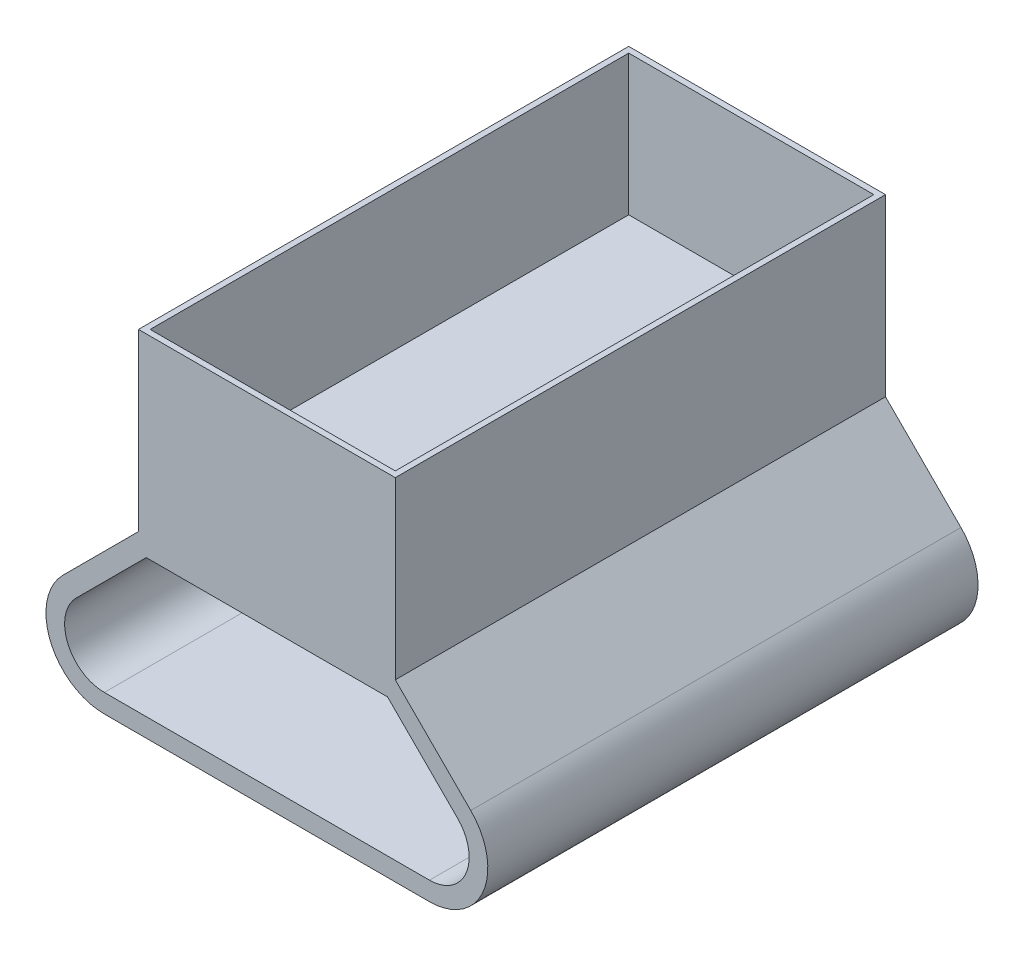
ISO-10303-21;
HEADER;
FILE_DESCRIPTION(('STEP AP214'),'2;1');
FILE_NAME('part.step','',(''),(''),'','','');
FILE_SCHEMA(('AUTOMOTIVE_DESIGN { 1 0 10303 214 1 1 1 1 }'));
ENDSEC;
DATA;
#1=APPLICATION_CONTEXT('core data for automotive mechanical design processes');
#2=APPLICATION_PROTOCOL_DEFINITION('international standard','automotive_design',2000,#1);
#3=PRODUCT_CONTEXT('',#1,'mechanical');
#4=PRODUCT('Part','Part','',(#3));
#5=PRODUCT_RELATED_PRODUCT_CATEGORY('part','',(#4));
#6=PRODUCT_DEFINITION_FORMATION('','',#4);
#7=PRODUCT_DEFINITION_CONTEXT('part definition',#1,'design');
#8=PRODUCT_DEFINITION('design','',#6,#7);
#9=PRODUCT_DEFINITION_SHAPE('','',#8);
#10=(LENGTH_UNIT() NAMED_UNIT(*) SI_UNIT(.MILLI.,.METRE.));
#11=(NAMED_UNIT(*) PLANE_ANGLE_UNIT() SI_UNIT($,.RADIAN.));
#12=(NAMED_UNIT(*) SI_UNIT($,.STERADIAN.) SOLID_ANGLE_UNIT());
#13=UNCERTAINTY_MEASURE_WITH_UNIT(LENGTH_MEASURE(1.E-05),#10,'distance_accuracy_value','');
#14=(GEOMETRIC_REPRESENTATION_CONTEXT(3) GLOBAL_UNCERTAINTY_ASSIGNED_CONTEXT((#13)) GLOBAL_UNIT_ASSIGNED_CONTEXT((#10,
#11,#12)) REPRESENTATION_CONTEXT('',''));
#15=CARTESIAN_POINT('',(0.,0.,0.));
#16=DIRECTION('',(0.,0.,1.));
#17=DIRECTION('',(1.,0.,0.));
#18=AXIS2_PLACEMENT_3D('',#15,#16,#17);
#19=CARTESIAN_POINT('',(-10.9999999999999,-1.73472347597681E-13,42.));
#20=DIRECTION('',(0.707106781186544,-0.707106781186551,0.));
#21=DIRECTION('',(0.707106781186551,0.707106781186544,0.));
#22=AXIS2_PLACEMENT_3D('',#19,#20,#21);
#23=PLANE('',#22);
#24=DIRECTION('',(-0.707106781186551,-0.707106781186544,0.));
#25=VECTOR('',#24,1.);
#26=CARTESIAN_POINT('',(-10.9999999999999,-1.73472347597681E-13,0.));
#27=LINE('',#26,#25);
#28=CARTESIAN_POINT('',(-10.9999999999999,0.,0.));
#29=VERTEX_POINT('',#28);
#30=CARTESIAN_POINT('',(-17.4644660940673,-6.46446609406727,0.));
#31=VERTEX_POINT('',#30);
#32=EDGE_CURVE('E254',#29,#31,#27,.T.);
#33=ORIENTED_EDGE('',*,*,#32,.T.);
#34=DIRECTION('',(0.,0.,-1.));
#35=VECTOR('',#34,1.);
#36=CARTESIAN_POINT('',(-17.4644660940673,-6.46446609406727,42.));
#37=LINE('',#36,#35);
#38=CARTESIAN_POINT('',(-17.4644660940673,-6.46446609406727,42.));
#39=VERTEX_POINT('',#38);
#40=EDGE_CURVE('E11',#39,#31,#37,.T.);
#41=ORIENTED_EDGE('',*,*,#40,.F.);
#42=DIRECTION('',(-0.707106781186551,-0.707106781186544,0.));
#43=VECTOR('',#42,1.);
#44=CARTESIAN_POINT('',(-10.9999999999999,-1.73472347597681E-13,42.));
#45=LINE('',#44,#43);
#46=CARTESIAN_POINT('',(-10.9999999999999,-1.73472347597681E-13,42.));
#47=VERTEX_POINT('',#46);
#48=EDGE_CURVE('E265',#47,#39,#45,.T.);
#49=ORIENTED_EDGE('',*,*,#48,.F.);
#50=DIRECTION('',(0.,0.,-1.));
#51=VECTOR('',#50,1.);
#52=CARTESIAN_POINT('',(-10.9999999999999,-1.73472347597681E-13,42.));
#53=LINE('',#52,#51);
#54=EDGE_CURVE('E277',#47,#29,#53,.T.);
#55=ORIENTED_EDGE('',*,*,#54,.T.);
#56=EDGE_LOOP('',(#33,#41,#49,#55));
#57=FACE_BOUND('',#56,.T.);
#58=ADVANCED_FACE('F35',(#57),#23,.F.);
#59=CARTESIAN_POINT('',(-13.9289321881346,-10.,42.));
#60=DIRECTION('',(0.,0.,-1.));
#61=DIRECTION('',(-1.,0.,0.));
#62=AXIS2_PLACEMENT_3D('',#59,#60,#61);
#63=CYLINDRICAL_SURFACE('',#62,4.99999999999998);
#64=CARTESIAN_POINT('',(-13.9289321881346,-10.,0.));
#65=DIRECTION('',(0.,0.,1.));
#66=DIRECTION('',(1.,0.,0.));
#67=AXIS2_PLACEMENT_3D('',#64,#65,#66);
#68=CIRCLE('',#67,4.99999999999998);
#69=CARTESIAN_POINT('',(-13.9289321881344,-15.0000000000002,0.));
#70=VERTEX_POINT('',#69);
#71=EDGE_CURVE('E280',#31,#70,#68,.T.);
#72=ORIENTED_EDGE('',*,*,#71,.T.);
#73=DIRECTION('',(0.,0.,-1.));
#74=VECTOR('',#73,1.);
#75=CARTESIAN_POINT('',(-13.9289321881344,-15.0000000000002,42.));
#76=LINE('',#75,#74);
#77=CARTESIAN_POINT('',(-13.9289321881344,-15.0000000000002,42.));
#78=VERTEX_POINT('',#77);
#79=EDGE_CURVE('E42',#78,#70,#76,.T.);
#80=ORIENTED_EDGE('',*,*,#79,.F.);
#81=CARTESIAN_POINT('',(-13.9289321881346,-10.,42.));
#82=DIRECTION('',(0.,0.,1.));
#83=DIRECTION('',(1.,0.,0.));
#84=AXIS2_PLACEMENT_3D('',#81,#82,#83);
#85=CIRCLE('',#84,4.99999999999998);
#86=EDGE_CURVE('E268',#39,#78,#85,.T.);
#87=ORIENTED_EDGE('',*,*,#86,.F.);
#88=ORIENTED_EDGE('',*,*,#40,.T.);
#89=EDGE_LOOP('',(#72,#80,#87,#88));
#90=FACE_BOUND('',#89,.T.);
#91=ADVANCED_FACE('F322',(#90),#63,.T.);
#92=CARTESIAN_POINT('',(-13.9289321881344,-15.0000000000002,42.));
#93=DIRECTION('',(0.,1.,0.));
#94=DIRECTION('',(-1.,0.,0.));
#95=AXIS2_PLACEMENT_3D('',#92,#93,#94);
#96=PLANE('',#95);
#97=DIRECTION('',(1.,0.,0.));
#98=VECTOR('',#97,1.);
#99=CARTESIAN_POINT('',(-13.9289321881344,-15.0000000000002,0.));
#100=LINE('',#99,#98);
#101=CARTESIAN_POINT('',(13.9289321881345,-14.9999999999999,0.));
#102=VERTEX_POINT('',#101);
#103=EDGE_CURVE('E282',#70,#102,#100,.T.);
#104=ORIENTED_EDGE('',*,*,#103,.T.);
#105=DIRECTION('',(0.,0.,-1.));
#106=VECTOR('',#105,1.);
#107=CARTESIAN_POINT('',(13.9289321881345,-14.9999999999999,42.));
#108=LINE('',#107,#106);
#109=CARTESIAN_POINT('',(13.9289321881345,-14.9999999999999,42.));
#110=VERTEX_POINT('',#109);
#111=EDGE_CURVE('E295',#110,#102,#108,.T.);
#112=ORIENTED_EDGE('',*,*,#111,.F.);
#113=DIRECTION('',(1.,0.,0.));
#114=VECTOR('',#113,1.);
#115=CARTESIAN_POINT('',(-13.9289321881344,-15.0000000000002,42.));
#116=LINE('',#115,#114);
#117=EDGE_CURVE('E271',#78,#110,#116,.T.);
#118=ORIENTED_EDGE('',*,*,#117,.F.);
#119=ORIENTED_EDGE('',*,*,#79,.T.);
#120=EDGE_LOOP('',(#104,#112,#118,#119));
#121=FACE_BOUND('',#120,.T.);
#122=ADVANCED_FACE('F302',(#121),#96,.F.);
#123=CARTESIAN_POINT('',(13.9289321881346,-9.99999999999999,42.));
#124=DIRECTION('',(0.,0.,-1.));
#125=DIRECTION('',(-1.,0.,0.));
#126=AXIS2_PLACEMENT_3D('',#123,#124,#125);
#127=CYLINDRICAL_SURFACE('',#126,4.99999999999994);
#128=CARTESIAN_POINT('',(13.9289321881346,-9.99999999999999,0.));
#129=DIRECTION('',(0.,0.,1.));
#130=DIRECTION('',(1.,0.,0.));
#131=AXIS2_PLACEMENT_3D('',#128,#129,#130);
#132=CIRCLE('',#131,4.99999999999994);
#133=CARTESIAN_POINT('',(17.4644660940674,-6.46446609406748,0.));
#134=VERTEX_POINT('',#133);
#135=EDGE_CURVE('E284',#102,#134,#132,.T.);
#136=ORIENTED_EDGE('',*,*,#135,.T.);
#137=DIRECTION('',(0.,0.,-1.));
#138=VECTOR('',#137,1.);
#139=CARTESIAN_POINT('',(17.4644660940674,-6.46446609406748,42.));
#140=LINE('',#139,#138);
#141=CARTESIAN_POINT('',(17.4644660940674,-6.46446609406748,42.));
#142=VERTEX_POINT('',#141);
#143=EDGE_CURVE('E292',#142,#134,#140,.T.);
#144=ORIENTED_EDGE('',*,*,#143,.F.);
#145=CARTESIAN_POINT('',(13.9289321881346,-9.99999999999999,42.));
#146=DIRECTION('',(0.,0.,1.));
#147=DIRECTION('',(1.,0.,0.));
#148=AXIS2_PLACEMENT_3D('',#145,#146,#147);
#149=CIRCLE('',#148,4.99999999999994);
#150=EDGE_CURVE('E273',#110,#142,#149,.T.);
#151=ORIENTED_EDGE('',*,*,#150,.F.);
#152=ORIENTED_EDGE('',*,*,#111,.T.);
#153=EDGE_LOOP('',(#136,#144,#151,#152));
#154=FACE_BOUND('',#153,.T.);
#155=ADVANCED_FACE('F311',(#154),#127,.T.);
#156=CARTESIAN_POINT('',(17.4644660940674,-6.46446609406748,42.));
#157=DIRECTION('',(-0.707106781186554,-0.707106781186541,0.));
#158=DIRECTION('',(0.707106781186541,-0.707106781186554,0.));
#159=AXIS2_PLACEMENT_3D('',#156,#157,#158);
#160=PLANE('',#159);
#161=DIRECTION('',(-0.707106781186541,0.707106781186554,0.));
#162=VECTOR('',#161,1.);
#163=CARTESIAN_POINT('',(17.4644660940674,-6.46446609406748,0.));
#164=LINE('',#163,#162);
#165=CARTESIAN_POINT('',(11.,0.,0.));
#166=VERTEX_POINT('',#165);
#167=EDGE_CURVE('E269',#134,#166,#164,.T.);
#168=ORIENTED_EDGE('',*,*,#167,.T.);
#169=DIRECTION('',(0.,0.,-1.));
#170=VECTOR('',#169,1.);
#171=CARTESIAN_POINT('',(11.,0.,42.));
#172=LINE('',#171,#170);
#173=CARTESIAN_POINT('',(11.,0.,42.));
#174=VERTEX_POINT('',#173);
#175=EDGE_CURVE('E289',#174,#166,#172,.T.);
#176=ORIENTED_EDGE('',*,*,#175,.F.);
#177=DIRECTION('',(-0.707106781186541,0.707106781186554,0.));
#178=VECTOR('',#177,1.);
#179=CARTESIAN_POINT('',(17.4644660940674,-6.46446609406748,42.));
#180=LINE('',#179,#178);
#181=EDGE_CURVE('E275',#142,#174,#180,.T.);
#182=ORIENTED_EDGE('',*,*,#181,.F.);
#183=ORIENTED_EDGE('',*,*,#143,.T.);
#184=EDGE_LOOP('',(#168,#176,#182,#183));
#185=FACE_BOUND('',#184,.T.);
#186=ADVANCED_FACE('F315',(#185),#160,.F.);
#187=CARTESIAN_POINT('',(-13.9289321881346,-10.,42.));
#188=DIRECTION('',(0.,0.,1.));
#189=DIRECTION('',(1.,0.,0.));
#190=AXIS2_PLACEMENT_3D('',#187,#188,#189);
#191=PLANE('',#190);
#192=CARTESIAN_POINT('',(13.9289321881346,-9.99999999999999,42.));
#193=DIRECTION('',(0.,0.,1.));
#194=DIRECTION('',(1.,0.,0.));
#195=AXIS2_PLACEMENT_3D('',#192,#193,#194);
#196=CIRCLE('',#195,3.39999999999991);
#197=CARTESIAN_POINT('',(13.9289321881345,-13.3999999999999,42.));
#198=VERTEX_POINT('',#197);
#199=CARTESIAN_POINT('',(16.3330952441689,-7.59583694396589,42.));
#200=VERTEX_POINT('',#199);
#201=EDGE_CURVE('E216',#198,#200,#196,.T.);
#202=ORIENTED_EDGE('',*,*,#201,.F.);
#203=DIRECTION('',(1.,0.,0.));
#204=VECTOR('',#203,1.);
#205=CARTESIAN_POINT('',(-13.9289321881345,-13.4000000000001,42.));
#206=LINE('',#205,#204);
#207=CARTESIAN_POINT('',(-13.9289321881345,-13.4000000000001,42.));
#208=VERTEX_POINT('',#207);
#209=EDGE_CURVE('E221',#208,#198,#206,.T.);
#210=ORIENTED_EDGE('',*,*,#209,.F.);
#211=CARTESIAN_POINT('',(-13.9289321881346,-10.,42.));
#212=DIRECTION('',(0.,0.,1.));
#213=DIRECTION('',(1.,0.,0.));
#214=AXIS2_PLACEMENT_3D('',#211,#212,#213);
#215=CIRCLE('',#214,3.40000000000003);
#216=CARTESIAN_POINT('',(-16.3330952441689,-7.59583694396575,42.));
#217=VERTEX_POINT('',#216);
#218=EDGE_CURVE('E247',#217,#208,#215,.T.);
#219=ORIENTED_EDGE('',*,*,#218,.F.);
#220=DIRECTION('',(-0.707106781186566,-0.707106781186528,0.));
#221=VECTOR('',#220,1.);
#222=CARTESIAN_POINT('',(-10.3372583002029,-1.60000000000017,42.));
#223=LINE('',#222,#221);
#224=CARTESIAN_POINT('',(-10.3372583002029,-1.60000000000017,42.));
#225=VERTEX_POINT('',#224);
#226=EDGE_CURVE('E244',#225,#217,#223,.T.);
#227=ORIENTED_EDGE('',*,*,#226,.F.);
#228=DIRECTION('',(-1.,0.,0.));
#229=VECTOR('',#228,1.);
#230=CARTESIAN_POINT('',(10.337258300203,-1.6,42.));
#231=LINE('',#230,#229);
#232=CARTESIAN_POINT('',(10.337258300203,-1.6,42.));
#233=VERTEX_POINT('',#232);
#234=EDGE_CURVE('E241',#233,#225,#231,.T.);
#235=ORIENTED_EDGE('',*,*,#234,.F.);
#236=DIRECTION('',(-0.707106781186544,0.707106781186551,0.));
#237=VECTOR('',#236,1.);
#238=CARTESIAN_POINT('',(16.3330952441689,-7.59583694396589,42.));
#239=LINE('',#238,#237);
#240=EDGE_CURVE('E238',#200,#233,#239,.T.);
#241=ORIENTED_EDGE('',*,*,#240,.F.);
#242=EDGE_LOOP('',(#202,#210,#219,#227,#235,#241));
#243=FACE_BOUND('',#242,.T.);
#244=ORIENTED_EDGE('',*,*,#48,.T.);
#245=ORIENTED_EDGE('',*,*,#86,.T.);
#246=ORIENTED_EDGE('',*,*,#117,.T.);
#247=ORIENTED_EDGE('',*,*,#150,.T.);
#248=ORIENTED_EDGE('',*,*,#181,.T.);
#249=DIRECTION('',(0.,-1.,0.));
#250=VECTOR('',#249,1.);
#251=CARTESIAN_POINT('',(10.9999999999999,15.0000000000001,42.));
#252=LINE('',#251,#250);
#253=CARTESIAN_POINT('',(10.9999999999999,15.0000000000001,42.));
#254=VERTEX_POINT('',#253);
#255=EDGE_CURVE('E210',#254,#174,#252,.T.);
#256=ORIENTED_EDGE('',*,*,#255,.F.);
#257=DIRECTION('',(1.,0.,0.));
#258=VECTOR('',#257,1.);
#259=CARTESIAN_POINT('',(-11.,14.9999999999999,42.));
#260=LINE('',#259,#258);
#261=CARTESIAN_POINT('',(-11.,14.9999999999999,42.));
#262=VERTEX_POINT('',#261);
#263=EDGE_CURVE('E198',#262,#254,#260,.T.);
#264=ORIENTED_EDGE('',*,*,#263,.F.);
#265=DIRECTION('',(0.,-1.,0.));
#266=VECTOR('',#265,1.);
#267=CARTESIAN_POINT('',(-11.,14.9999999999999,42.));
#268=LINE('',#267,#266);
#269=EDGE_CURVE('E213',#262,#47,#268,.T.);
#270=ORIENTED_EDGE('',*,*,#269,.T.);
#271=EDGE_LOOP('',(#244,#245,#246,#247,#248,#256,#264,#270));
#272=FACE_BOUND('',#271,.T.);
#273=ADVANCED_FACE('F319',(#243,#272),#191,.T.);
#274=CARTESIAN_POINT('',(-13.9289321881346,-10.,0.));
#275=DIRECTION('',(0.,0.,1.));
#276=DIRECTION('',(1.,0.,0.));
#277=AXIS2_PLACEMENT_3D('',#274,#275,#276);
#278=PLANE('',#277);
#279=DIRECTION('',(1.,0.,0.));
#280=VECTOR('',#279,1.);
#281=CARTESIAN_POINT('',(-13.9289321881345,-13.4000000000001,0.));
#282=LINE('',#281,#280);
#283=CARTESIAN_POINT('',(-13.9289321881345,-13.4000000000001,0.));
#284=VERTEX_POINT('',#283);
#285=CARTESIAN_POINT('',(13.9289321881345,-13.3999999999999,0.));
#286=VERTEX_POINT('',#285);
#287=EDGE_CURVE('E233',#284,#286,#282,.T.);
#288=ORIENTED_EDGE('',*,*,#287,.T.);
#289=CARTESIAN_POINT('',(13.9289321881346,-9.99999999999999,0.));
#290=DIRECTION('',(0.,0.,1.));
#291=DIRECTION('',(1.,0.,0.));
#292=AXIS2_PLACEMENT_3D('',#289,#290,#291);
#293=CIRCLE('',#292,3.39999999999991);
#294=CARTESIAN_POINT('',(16.3330952441689,-7.59583694396589,0.));
#295=VERTEX_POINT('',#294);
#296=EDGE_CURVE('E217',#286,#295,#293,.T.);
#297=ORIENTED_EDGE('',*,*,#296,.T.);
#298=DIRECTION('',(-0.707106781186544,0.707106781186551,0.));
#299=VECTOR('',#298,1.);
#300=CARTESIAN_POINT('',(16.3330952441689,-7.59583694396589,0.));
#301=LINE('',#300,#299);
#302=CARTESIAN_POINT('',(10.337258300203,-1.6,0.));
#303=VERTEX_POINT('',#302);
#304=EDGE_CURVE('E220',#295,#303,#301,.T.);
#305=ORIENTED_EDGE('',*,*,#304,.T.);
#306=DIRECTION('',(-1.,0.,0.));
#307=VECTOR('',#306,1.);
#308=CARTESIAN_POINT('',(10.337258300203,-1.6,0.));
#309=LINE('',#308,#307);
#310=CARTESIAN_POINT('',(-10.3372583002029,-1.60000000000017,0.));
#311=VERTEX_POINT('',#310);
#312=EDGE_CURVE('E224',#303,#311,#309,.T.);
#313=ORIENTED_EDGE('',*,*,#312,.T.);
#314=DIRECTION('',(-0.707106781186566,-0.707106781186528,0.));
#315=VECTOR('',#314,1.);
#316=CARTESIAN_POINT('',(-10.3372583002029,-1.60000000000017,0.));
#317=LINE('',#316,#315);
#318=CARTESIAN_POINT('',(-16.3330952441689,-7.59583694396575,0.));
#319=VERTEX_POINT('',#318);
#320=EDGE_CURVE('E227',#311,#319,#317,.T.);
#321=ORIENTED_EDGE('',*,*,#320,.T.);
#322=CARTESIAN_POINT('',(-13.9289321881346,-10.,0.));
#323=DIRECTION('',(0.,0.,1.));
#324=DIRECTION('',(1.,0.,0.));
#325=AXIS2_PLACEMENT_3D('',#322,#323,#324);
#326=CIRCLE('',#325,3.40000000000003);
#327=EDGE_CURVE('E230',#319,#284,#326,.T.);
#328=ORIENTED_EDGE('',*,*,#327,.T.);
#329=EDGE_LOOP('',(#288,#297,#305,#313,#321,#328));
#330=FACE_BOUND('',#329,.T.);
#331=ORIENTED_EDGE('',*,*,#32,.F.);
#332=DIRECTION('',(0.,-1.,0.));
#333=VECTOR('',#332,1.);
#334=CARTESIAN_POINT('',(-11.,14.9999999999999,0.));
#335=LINE('',#334,#333);
#336=CARTESIAN_POINT('',(-11.,14.9999999999999,0.));
#337=VERTEX_POINT('',#336);
#338=EDGE_CURVE('E204',#337,#29,#335,.T.);
#339=ORIENTED_EDGE('',*,*,#338,.F.);
#340=DIRECTION('',(-1.,0.,0.));
#341=VECTOR('',#340,1.);
#342=CARTESIAN_POINT('',(-11.,14.9999999999999,0.));
#343=LINE('',#342,#341);
#344=CARTESIAN_POINT('',(10.9999999999999,15.0000000000001,0.));
#345=VERTEX_POINT('',#344);
#346=EDGE_CURVE('E202',#345,#337,#343,.T.);
#347=ORIENTED_EDGE('',*,*,#346,.F.);
#348=DIRECTION('',(0.,-1.,0.));
#349=VECTOR('',#348,1.);
#350=CARTESIAN_POINT('',(10.9999999999999,15.0000000000001,0.));
#351=LINE('',#350,#349);
#352=EDGE_CURVE('E207',#345,#166,#351,.T.);
#353=ORIENTED_EDGE('',*,*,#352,.T.);
#354=ORIENTED_EDGE('',*,*,#167,.F.);
#355=ORIENTED_EDGE('',*,*,#135,.F.);
#356=ORIENTED_EDGE('',*,*,#103,.F.);
#357=ORIENTED_EDGE('',*,*,#71,.F.);
#358=EDGE_LOOP('',(#331,#339,#347,#353,#354,#355,#356,#357));
#359=FACE_BOUND('',#358,.T.);
#360=ADVANCED_FACE('F307',(#330,#359),#278,.F.);
#361=CARTESIAN_POINT('',(13.9289321881346,-9.99999999999999,0.));
#362=DIRECTION('',(0.,0.,1.));
#363=DIRECTION('',(1.,0.,0.));
#364=AXIS2_PLACEMENT_3D('',#361,#362,#363);
#365=CYLINDRICAL_SURFACE('',#364,3.39999999999991);
#366=ORIENTED_EDGE('',*,*,#201,.T.);
#367=DIRECTION('',(0.,0.,1.));
#368=VECTOR('',#367,1.);
#369=CARTESIAN_POINT('',(16.3330952441689,-7.59583694396589,0.));
#370=LINE('',#369,#368);
#371=EDGE_CURVE('E236',#295,#200,#370,.T.);
#372=ORIENTED_EDGE('',*,*,#371,.F.);
#373=ORIENTED_EDGE('',*,*,#296,.F.);
#374=DIRECTION('',(0.,0.,1.));
#375=VECTOR('',#374,1.);
#376=CARTESIAN_POINT('',(13.9289321881345,-13.3999999999999,0.));
#377=LINE('',#376,#375);
#378=EDGE_CURVE('E252',#286,#198,#377,.T.);
#379=ORIENTED_EDGE('',*,*,#378,.T.);
#380=EDGE_LOOP('',(#366,#372,#373,#379));
#381=FACE_BOUND('',#380,.T.);
#382=ADVANCED_FACE('F362',(#381),#365,.F.);
#383=CARTESIAN_POINT('',(-13.9289321881345,-13.4000000000001,0.));
#384=DIRECTION('',(0.,-1.,0.));
#385=DIRECTION('',(1.,0.,0.));
#386=AXIS2_PLACEMENT_3D('',#383,#384,#385);
#387=PLANE('',#386);
#388=ORIENTED_EDGE('',*,*,#209,.T.);
#389=ORIENTED_EDGE('',*,*,#378,.F.);
#390=ORIENTED_EDGE('',*,*,#287,.F.);
#391=DIRECTION('',(0.,0.,1.));
#392=VECTOR('',#391,1.);
#393=CARTESIAN_POINT('',(-13.9289321881345,-13.4000000000001,0.));
#394=LINE('',#393,#392);
#395=EDGE_CURVE('E255',#284,#208,#394,.T.);
#396=ORIENTED_EDGE('',*,*,#395,.T.);
#397=EDGE_LOOP('',(#388,#389,#390,#396));
#398=FACE_BOUND('',#397,.T.);
#399=ADVANCED_FACE('F369',(#398),#387,.F.);
#400=CARTESIAN_POINT('',(-13.9289321881346,-10.,0.));
#401=DIRECTION('',(0.,0.,1.));
#402=DIRECTION('',(1.,0.,0.));
#403=AXIS2_PLACEMENT_3D('',#400,#401,#402);
#404=CYLINDRICAL_SURFACE('',#403,3.40000000000003);
#405=ORIENTED_EDGE('',*,*,#218,.T.);
#406=ORIENTED_EDGE('',*,*,#395,.F.);
#407=ORIENTED_EDGE('',*,*,#327,.F.);
#408=DIRECTION('',(0.,0.,1.));
#409=VECTOR('',#408,1.);
#410=CARTESIAN_POINT('',(-16.3330952441689,-7.59583694396575,0.));
#411=LINE('',#410,#409);
#412=EDGE_CURVE('E257',#319,#217,#411,.T.);
#413=ORIENTED_EDGE('',*,*,#412,.T.);
#414=EDGE_LOOP('',(#405,#406,#407,#413));
#415=FACE_BOUND('',#414,.T.);
#416=ADVANCED_FACE('F382',(#415),#404,.F.);
#417=CARTESIAN_POINT('',(-10.3372583002029,-1.60000000000017,0.));
#418=DIRECTION('',(-0.707106781186529,0.707106781186567,0.));
#419=DIRECTION('',(-0.707106781186567,-0.707106781186528,0.));
#420=AXIS2_PLACEMENT_3D('',#417,#418,#419);
#421=PLANE('',#420);
#422=ORIENTED_EDGE('',*,*,#226,.T.);
#423=ORIENTED_EDGE('',*,*,#412,.F.);
#424=ORIENTED_EDGE('',*,*,#320,.F.);
#425=DIRECTION('',(0.,0.,1.));
#426=VECTOR('',#425,1.);
#427=CARTESIAN_POINT('',(-10.3372583002029,-1.60000000000017,0.));
#428=LINE('',#427,#426);
#429=EDGE_CURVE('E259',#311,#225,#428,.T.);
#430=ORIENTED_EDGE('',*,*,#429,.T.);
#431=EDGE_LOOP('',(#422,#423,#424,#430));
#432=FACE_BOUND('',#431,.T.);
#433=ADVANCED_FACE('F378',(#432),#421,.F.);
#434=CARTESIAN_POINT('',(10.337258300203,-1.6,0.));
#435=DIRECTION('',(0.,1.,0.));
#436=DIRECTION('',(-1.,0.,0.));
#437=AXIS2_PLACEMENT_3D('',#434,#435,#436);
#438=PLANE('',#437);
#439=ORIENTED_EDGE('',*,*,#234,.T.);
#440=ORIENTED_EDGE('',*,*,#429,.F.);
#441=ORIENTED_EDGE('',*,*,#312,.F.);
#442=DIRECTION('',(0.,0.,1.));
#443=VECTOR('',#442,1.);
#444=CARTESIAN_POINT('',(10.337258300203,-1.6,0.));
#445=LINE('',#444,#443);
#446=EDGE_CURVE('E261',#303,#233,#445,.T.);
#447=ORIENTED_EDGE('',*,*,#446,.T.);
#448=EDGE_LOOP('',(#439,#440,#441,#447));
#449=FACE_BOUND('',#448,.T.);
#450=ADVANCED_FACE('F374',(#449),#438,.F.);
#451=CARTESIAN_POINT('',(16.3330952441689,-7.59583694396589,0.));
#452=DIRECTION('',(0.707106781186551,0.707106781186544,0.));
#453=DIRECTION('',(-0.707106781186544,0.707106781186551,0.));
#454=AXIS2_PLACEMENT_3D('',#451,#452,#453);
#455=PLANE('',#454);
#456=ORIENTED_EDGE('',*,*,#240,.T.);
#457=ORIENTED_EDGE('',*,*,#446,.F.);
#458=ORIENTED_EDGE('',*,*,#304,.F.);
#459=ORIENTED_EDGE('',*,*,#371,.T.);
#460=EDGE_LOOP('',(#456,#457,#458,#459));
#461=FACE_BOUND('',#460,.T.);
#462=ADVANCED_FACE('F371',(#461),#455,.F.);
#463=CARTESIAN_POINT('',(-1.21032055932865E-13,15.,0.));
#464=DIRECTION('',(0.,1.,0.));
#465=DIRECTION('',(-1.,0.,0.));
#466=AXIS2_PLACEMENT_3D('',#463,#464,#465);
#467=PLANE('',#466);
#468=DIRECTION('',(0.,0.,1.));
#469=VECTOR('',#468,1.);
#470=CARTESIAN_POINT('',(-11.,14.9999999999999,0.));
#471=LINE('',#470,#469);
#472=EDGE_CURVE('E195',#337,#262,#471,.T.);
#473=ORIENTED_EDGE('',*,*,#472,.T.);
#474=ORIENTED_EDGE('',*,*,#263,.T.);
#475=DIRECTION('',(0.,0.,-1.));
#476=VECTOR('',#475,1.);
#477=CARTESIAN_POINT('',(10.9999999999999,15.0000000000001,0.));
#478=LINE('',#477,#476);
#479=EDGE_CURVE('E200',#254,#345,#478,.T.);
#480=ORIENTED_EDGE('',*,*,#479,.T.);
#481=ORIENTED_EDGE('',*,*,#346,.T.);
#482=EDGE_LOOP('',(#473,#474,#480,#481));
#483=FACE_BOUND('',#482,.T.);
#484=DIRECTION('',(1.,0.,0.));
#485=VECTOR('',#484,1.);
#486=CARTESIAN_POINT('',(-10.5000000000001,14.9999999999999,41.5));
#487=LINE('',#486,#485);
#488=CARTESIAN_POINT('',(-10.5000000000001,14.9999999999999,41.5));
#489=VERTEX_POINT('',#488);
#490=CARTESIAN_POINT('',(10.4999999999999,15.0000000000001,41.5));
#491=VERTEX_POINT('',#490);
#492=EDGE_CURVE('E185',#489,#491,#487,.T.);
#493=ORIENTED_EDGE('',*,*,#492,.F.);
#494=DIRECTION('',(0.,0.,1.));
#495=VECTOR('',#494,1.);
#496=CARTESIAN_POINT('',(-10.5000000000001,14.9999999999999,0.499999999999998));
#497=LINE('',#496,#495);
#498=CARTESIAN_POINT('',(-10.5000000000001,14.9999999999999,0.499999999999998));
#499=VERTEX_POINT('',#498);
#500=EDGE_CURVE('E183',#499,#489,#497,.T.);
#501=ORIENTED_EDGE('',*,*,#500,.F.);
#502=DIRECTION('',(-1.,0.,0.));
#503=VECTOR('',#502,1.);
#504=CARTESIAN_POINT('',(-10.5000000000001,14.9999999999999,0.499999999999998));
#505=LINE('',#504,#503);
#506=CARTESIAN_POINT('',(10.5,15.0000000000001,0.499999999999994));
#507=VERTEX_POINT('',#506);
#508=EDGE_CURVE('E167',#507,#499,#505,.T.);
#509=ORIENTED_EDGE('',*,*,#508,.F.);
#510=DIRECTION('',(0.,0.,-1.));
#511=VECTOR('',#510,1.);
#512=CARTESIAN_POINT('',(10.4999999999999,15.0000000000001,0.499999999999994));
#513=LINE('',#512,#511);
#514=EDGE_CURVE('E187',#491,#507,#513,.T.);
#515=ORIENTED_EDGE('',*,*,#514,.F.);
#516=EDGE_LOOP('',(#493,#501,#509,#515));
#517=FACE_BOUND('',#516,.T.);
#518=ADVANCED_FACE('F332',(#483,#517),#467,.T.);
#519=CARTESIAN_POINT('',(-11.,14.9999999999999,0.));
#520=DIRECTION('',(1.,0.,0.));
#521=DIRECTION('',(0.,1.,0.));
#522=AXIS2_PLACEMENT_3D('',#519,#520,#521);
#523=PLANE('',#522);
#524=ORIENTED_EDGE('',*,*,#54,.F.);
#525=ORIENTED_EDGE('',*,*,#269,.F.);
#526=ORIENTED_EDGE('',*,*,#472,.F.);
#527=ORIENTED_EDGE('',*,*,#338,.T.);
#528=EDGE_LOOP('',(#524,#525,#526,#527));
#529=FACE_BOUND('',#528,.T.);
#530=ADVANCED_FACE('F330',(#529),#523,.F.);
#531=CARTESIAN_POINT('',(10.9999999999999,15.0000000000001,0.));
#532=DIRECTION('',(-1.,0.,0.));
#533=DIRECTION('',(0.,-1.,0.));
#534=AXIS2_PLACEMENT_3D('',#531,#532,#533);
#535=PLANE('',#534);
#536=ORIENTED_EDGE('',*,*,#175,.T.);
#537=ORIENTED_EDGE('',*,*,#352,.F.);
#538=ORIENTED_EDGE('',*,*,#479,.F.);
#539=ORIENTED_EDGE('',*,*,#255,.T.);
#540=EDGE_LOOP('',(#536,#537,#538,#539));
#541=FACE_BOUND('',#540,.T.);
#542=ADVANCED_FACE('F336',(#541),#535,.F.);
#543=CARTESIAN_POINT('',(-10.5000000000001,14.9999999999999,0.499999999999998));
#544=DIRECTION('',(1.,0.,0.));
#545=DIRECTION('',(0.,1.,0.));
#546=AXIS2_PLACEMENT_3D('',#543,#544,#545);
#547=PLANE('',#546);
#548=DIRECTION('',(0.,0.,1.));
#549=VECTOR('',#548,1.);
#550=CARTESIAN_POINT('',(-10.5,2.99999999999992,0.));
#551=LINE('',#550,#549);
#552=CARTESIAN_POINT('',(-10.5,2.99999999999992,0.499999999999998));
#553=VERTEX_POINT('',#552);
#554=CARTESIAN_POINT('',(-10.5,3.,41.5));
#555=VERTEX_POINT('',#554);
#556=EDGE_CURVE('E173',#553,#555,#551,.T.);
#557=ORIENTED_EDGE('',*,*,#556,.F.);
#558=DIRECTION('',(0.,-1.,0.));
#559=VECTOR('',#558,1.);
#560=CARTESIAN_POINT('',(-10.5000000000001,14.9999999999999,0.499999999999998));
#561=LINE('',#560,#559);
#562=EDGE_CURVE('E161',#499,#553,#561,.T.);
#563=ORIENTED_EDGE('',*,*,#562,.F.);
#564=ORIENTED_EDGE('',*,*,#500,.T.);
#565=DIRECTION('',(0.,-1.,0.));
#566=VECTOR('',#565,1.);
#567=CARTESIAN_POINT('',(-10.5000000000001,14.9999999999999,41.5));
#568=LINE('',#567,#566);
#569=EDGE_CURVE('E175',#489,#555,#568,.T.);
#570=ORIENTED_EDGE('',*,*,#569,.T.);
#571=EDGE_LOOP('',(#557,#563,#564,#570));
#572=FACE_BOUND('',#571,.T.);
#573=ADVANCED_FACE('F174',(#572),#547,.T.);
#574=CARTESIAN_POINT('',(-10.5000000000001,14.9999999999999,41.5));
#575=DIRECTION('',(0.,0.,-1.));
#576=DIRECTION('',(-1.,0.,0.));
#577=AXIS2_PLACEMENT_3D('',#574,#575,#576);
#578=PLANE('',#577);
#579=DIRECTION('',(1.,0.,0.));
#580=VECTOR('',#579,1.);
#581=CARTESIAN_POINT('',(0.,3.,41.5));
#582=LINE('',#581,#580);
#583=CARTESIAN_POINT('',(10.5,3.00000000000009,41.5));
#584=VERTEX_POINT('',#583);
#585=EDGE_CURVE('E49',#555,#584,#582,.T.);
#586=ORIENTED_EDGE('',*,*,#585,.F.);
#587=ORIENTED_EDGE('',*,*,#569,.F.);
#588=ORIENTED_EDGE('',*,*,#492,.T.);
#589=DIRECTION('',(0.,-1.,0.));
#590=VECTOR('',#589,1.);
#591=CARTESIAN_POINT('',(10.4999999999999,15.0000000000001,41.5));
#592=LINE('',#591,#590);
#593=EDGE_CURVE('E192',#491,#584,#592,.T.);
#594=ORIENTED_EDGE('',*,*,#593,.T.);
#595=EDGE_LOOP('',(#586,#587,#588,#594));
#596=FACE_BOUND('',#595,.T.);
#597=ADVANCED_FACE('F343',(#596),#578,.T.);
#598=CARTESIAN_POINT('',(10.4999999999999,15.0000000000001,0.499999999999994));
#599=DIRECTION('',(-1.,0.,0.));
#600=DIRECTION('',(0.,-1.,0.));
#601=AXIS2_PLACEMENT_3D('',#598,#599,#600);
#602=PLANE('',#601);
#603=DIRECTION('',(0.,0.,1.));
#604=VECTOR('',#603,1.);
#605=CARTESIAN_POINT('',(10.5,3.00000000000008,0.));
#606=LINE('',#605,#604);
#607=CARTESIAN_POINT('',(10.5,3.,0.499999999999994));
#608=VERTEX_POINT('',#607);
#609=EDGE_CURVE('E57',#608,#584,#606,.T.);
#610=ORIENTED_EDGE('',*,*,#609,.T.);
#611=ORIENTED_EDGE('',*,*,#593,.F.);
#612=ORIENTED_EDGE('',*,*,#514,.T.);
#613=DIRECTION('',(0.,-1.,0.));
#614=VECTOR('',#613,1.);
#615=CARTESIAN_POINT('',(10.4999999999999,15.0000000000001,0.499999999999994));
#616=LINE('',#615,#614);
#617=EDGE_CURVE('E170',#507,#608,#616,.T.);
#618=ORIENTED_EDGE('',*,*,#617,.T.);
#619=EDGE_LOOP('',(#610,#611,#612,#618));
#620=FACE_BOUND('',#619,.T.);
#621=ADVANCED_FACE('F450',(#620),#602,.T.);
#622=CARTESIAN_POINT('',(-10.5000000000001,14.9999999999999,0.499999999999998));
#623=DIRECTION('',(0.,0.,1.));
#624=DIRECTION('',(1.,0.,0.));
#625=AXIS2_PLACEMENT_3D('',#622,#623,#624);
#626=PLANE('',#625);
#627=DIRECTION('',(1.,0.,0.));
#628=VECTOR('',#627,1.);
#629=CARTESIAN_POINT('',(0.,3.,0.499999999999996));
#630=LINE('',#629,#628);
#631=EDGE_CURVE('E165',#553,#608,#630,.T.);
#632=ORIENTED_EDGE('',*,*,#631,.T.);
#633=ORIENTED_EDGE('',*,*,#617,.F.);
#634=ORIENTED_EDGE('',*,*,#508,.T.);
#635=ORIENTED_EDGE('',*,*,#562,.T.);
#636=EDGE_LOOP('',(#632,#633,#634,#635));
#637=FACE_BOUND('',#636,.T.);
#638=ADVANCED_FACE('F163',(#637),#626,.T.);
#639=CARTESIAN_POINT('',(0.,3.,0.));
#640=DIRECTION('',(0.,1.,0.));
#641=DIRECTION('',(-1.,0.,0.));
#642=AXIS2_PLACEMENT_3D('',#639,#640,#641);
#643=PLANE('',#642);
#644=ORIENTED_EDGE('',*,*,#609,.F.);
#645=ORIENTED_EDGE('',*,*,#631,.F.);
#646=ORIENTED_EDGE('',*,*,#556,.T.);
#647=ORIENTED_EDGE('',*,*,#585,.T.);
#648=EDGE_LOOP('',(#644,#645,#646,#647));
#649=FACE_BOUND('',#648,.T.);
#650=ADVANCED_FACE('F178',(#649),#643,.T.);
#651=CLOSED_SHELL('',(#58,#91,#122,#155,#186,#273,#360,#382,#399,#416,#433,#450,#462,#518,#530,
#542,#573,#597,#621,#638,#650));
#652=MANIFOLD_SOLID_BREP('B2',#651);
#653=ADVANCED_BREP_SHAPE_REPRESENTATION('',(#18,#652),#14);
#654=SHAPE_DEFINITION_REPRESENTATION(#9,#653);
ENDSEC;
END-ISO-10303-21;
